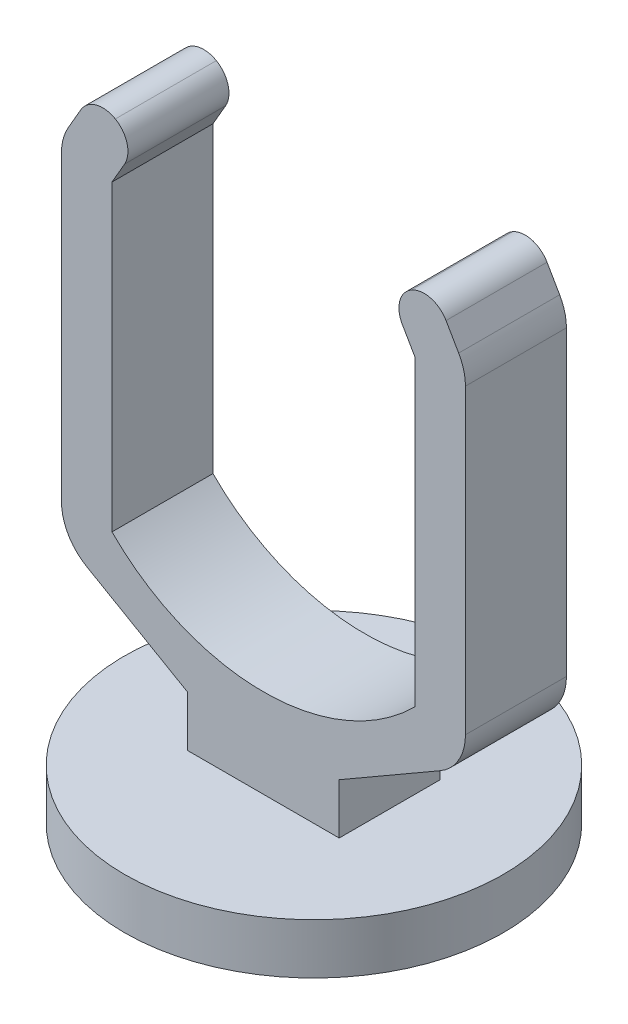
ISO-10303-21;
HEADER;
FILE_DESCRIPTION(('STEP AP214'),'2;1');
FILE_NAME('part.step','',(''),(''),'','','');
FILE_SCHEMA(('AUTOMOTIVE_DESIGN { 1 0 10303 214 1 1 1 1 }'));
ENDSEC;
DATA;
#1=APPLICATION_CONTEXT('core data for automotive mechanical design processes');
#2=APPLICATION_PROTOCOL_DEFINITION('international standard','automotive_design',2000,#1);
#3=PRODUCT_CONTEXT('',#1,'mechanical');
#4=PRODUCT('Part','Part','',(#3));
#5=PRODUCT_RELATED_PRODUCT_CATEGORY('part','',(#4));
#6=PRODUCT_DEFINITION_FORMATION('','',#4);
#7=PRODUCT_DEFINITION_CONTEXT('part definition',#1,'design');
#8=PRODUCT_DEFINITION('design','',#6,#7);
#9=PRODUCT_DEFINITION_SHAPE('','',#8);
#10=(LENGTH_UNIT() NAMED_UNIT(*) SI_UNIT(.MILLI.,.METRE.));
#11=(NAMED_UNIT(*) PLANE_ANGLE_UNIT() SI_UNIT($,.RADIAN.));
#12=(NAMED_UNIT(*) SI_UNIT($,.STERADIAN.) SOLID_ANGLE_UNIT());
#13=UNCERTAINTY_MEASURE_WITH_UNIT(LENGTH_MEASURE(1.E-05),#10,'distance_accuracy_value','');
#14=(GEOMETRIC_REPRESENTATION_CONTEXT(3) GLOBAL_UNCERTAINTY_ASSIGNED_CONTEXT((#13)) GLOBAL_UNIT_ASSIGNED_CONTEXT((#10,
#11,#12)) REPRESENTATION_CONTEXT('',''));
#15=CARTESIAN_POINT('',(0.,0.,0.));
#16=DIRECTION('',(0.,0.,1.));
#17=DIRECTION('',(1.,0.,0.));
#18=AXIS2_PLACEMENT_3D('',#15,#16,#17);
#19=CARTESIAN_POINT('',(0.,10.,0.));
#20=DIRECTION('',(0.,1.,0.));
#21=DIRECTION('',(0.,0.,1.));
#22=AXIS2_PLACEMENT_3D('',#19,#20,#21);
#23=PLANE('',#22);
#24=CARTESIAN_POINT('',(0.,10.,0.));
#25=DIRECTION('',(0.,1.,0.));
#26=DIRECTION('',(0.,0.,1.));
#27=AXIS2_PLACEMENT_3D('',#24,#25,#26);
#28=CIRCLE('',#27,37.5);
#29=CARTESIAN_POINT('',(0.,10.,37.5));
#30=VERTEX_POINT('',#29);
#31=EDGE_CURVE('E295',#30,#30,#28,.T.);
#32=ORIENTED_EDGE('',*,*,#31,.T.);
#33=EDGE_LOOP('',(#32));
#34=FACE_BOUND('',#33,.T.);
#35=DIRECTION('',(0.,0.,1.));
#36=VECTOR('',#35,1.);
#37=CARTESIAN_POINT('',(-15.,10.,0.));
#38=LINE('',#37,#36);
#39=CARTESIAN_POINT('',(-15.,10.,-10.));
#40=VERTEX_POINT('',#39);
#41=CARTESIAN_POINT('',(-15.,10.,10.));
#42=VERTEX_POINT('',#41);
#43=EDGE_CURVE('E291',#40,#42,#38,.T.);
#44=ORIENTED_EDGE('',*,*,#43,.F.);
#45=DIRECTION('',(1.,0.,0.));
#46=VECTOR('',#45,1.);
#47=CARTESIAN_POINT('',(0.,10.,-10.));
#48=LINE('',#47,#46);
#49=CARTESIAN_POINT('',(15.,10.,-10.));
#50=VERTEX_POINT('',#49);
#51=EDGE_CURVE('E287',#40,#50,#48,.T.);
#52=ORIENTED_EDGE('',*,*,#51,.T.);
#53=DIRECTION('',(0.,0.,-1.));
#54=VECTOR('',#53,1.);
#55=CARTESIAN_POINT('',(15.,10.,0.));
#56=LINE('',#55,#54);
#57=CARTESIAN_POINT('',(15.,10.,10.));
#58=VERTEX_POINT('',#57);
#59=EDGE_CURVE('E289',#58,#50,#56,.T.);
#60=ORIENTED_EDGE('',*,*,#59,.F.);
#61=DIRECTION('',(1.,0.,0.));
#62=VECTOR('',#61,1.);
#63=CARTESIAN_POINT('',(0.,10.,10.));
#64=LINE('',#63,#62);
#65=EDGE_CURVE('E195',#42,#58,#64,.T.);
#66=ORIENTED_EDGE('',*,*,#65,.F.);
#67=EDGE_LOOP('',(#44,#52,#60,#66));
#68=FACE_BOUND('',#67,.T.);
#69=ADVANCED_FACE('F36',(#34,#68),#23,.T.);
#70=CARTESIAN_POINT('',(0.,10.,0.));
#71=DIRECTION('',(0.,-1.,0.));
#72=DIRECTION('',(0.,0.,-1.));
#73=AXIS2_PLACEMENT_3D('',#70,#71,#72);
#74=CYLINDRICAL_SURFACE('',#73,37.5);
#75=ORIENTED_EDGE('',*,*,#31,.F.);
#76=EDGE_LOOP('',(#75));
#77=FACE_BOUND('',#76,.T.);
#78=CARTESIAN_POINT('',(0.,0.,0.));
#79=DIRECTION('',(0.,1.,0.));
#80=DIRECTION('',(0.,0.,1.));
#81=AXIS2_PLACEMENT_3D('',#78,#79,#80);
#82=CIRCLE('',#81,37.5);
#83=CARTESIAN_POINT('',(0.,0.,37.5));
#84=VERTEX_POINT('',#83);
#85=EDGE_CURVE('E294',#84,#84,#82,.T.);
#86=ORIENTED_EDGE('',*,*,#85,.T.);
#87=EDGE_LOOP('',(#86));
#88=FACE_BOUND('',#87,.T.);
#89=ADVANCED_FACE('F442',(#77,#88),#74,.T.);
#90=CARTESIAN_POINT('',(0.,0.,0.));
#91=DIRECTION('',(0.,1.,0.));
#92=DIRECTION('',(0.,0.,1.));
#93=AXIS2_PLACEMENT_3D('',#90,#91,#92);
#94=PLANE('',#93);
#95=ORIENTED_EDGE('',*,*,#85,.F.);
#96=EDGE_LOOP('',(#95));
#97=FACE_BOUND('',#96,.T.);
#98=ADVANCED_FACE('F448',(#97),#94,.F.);
#99=CARTESIAN_POINT('',(-15.,20.,-10.));
#100=DIRECTION('',(-1.,0.,0.));
#101=DIRECTION('',(0.,-1.,0.));
#102=AXIS2_PLACEMENT_3D('',#99,#100,#101);
#103=PLANE('',#102);
#104=DIRECTION('',(0.,-1.,0.));
#105=VECTOR('',#104,1.);
#106=CARTESIAN_POINT('',(-15.,20.,-10.));
#107=LINE('',#106,#105);
#108=CARTESIAN_POINT('',(-15.,20.,-10.));
#109=VERTEX_POINT('',#108);
#110=EDGE_CURVE('E209',#109,#40,#107,.T.);
#111=ORIENTED_EDGE('',*,*,#110,.T.);
#112=ORIENTED_EDGE('',*,*,#43,.T.);
#113=DIRECTION('',(0.,-1.,0.));
#114=VECTOR('',#113,1.);
#115=CARTESIAN_POINT('',(-15.,20.,10.));
#116=LINE('',#115,#114);
#117=CARTESIAN_POINT('',(-15.,20.,10.));
#118=VERTEX_POINT('',#117);
#119=EDGE_CURVE('E243',#118,#42,#116,.T.);
#120=ORIENTED_EDGE('',*,*,#119,.F.);
#121=DIRECTION('',(0.,0.,1.));
#122=VECTOR('',#121,1.);
#123=CARTESIAN_POINT('',(-15.,20.,-10.));
#124=LINE('',#123,#122);
#125=EDGE_CURVE('E275',#109,#118,#124,.T.);
#126=ORIENTED_EDGE('',*,*,#125,.F.);
#127=EDGE_LOOP('',(#111,#112,#120,#126));
#128=FACE_BOUND('',#127,.T.);
#129=ADVANCED_FACE('F439',(#128),#103,.T.);
#130=CARTESIAN_POINT('',(-40.,34.4337567297405,-10.));
#131=DIRECTION('',(-0.499999999999998,-0.86602540378444,0.));
#132=DIRECTION('',(0.86602540378444,-0.499999999999998,0.));
#133=AXIS2_PLACEMENT_3D('',#130,#131,#132);
#134=PLANE('',#133);
#135=DIRECTION('',(0.86602540378444,-0.499999999999998,0.));
#136=VECTOR('',#135,1.);
#137=CARTESIAN_POINT('',(-40.,34.4337567297405,10.));
#138=LINE('',#137,#136);
#139=CARTESIAN_POINT('',(-35.,31.5470053837924,10.));
#140=VERTEX_POINT('',#139);
#141=EDGE_CURVE('E241',#140,#118,#138,.T.);
#142=ORIENTED_EDGE('',*,*,#141,.F.);
#143=DIRECTION('',(0.,0.,1.));
#144=VECTOR('',#143,1.);
#145=CARTESIAN_POINT('',(-35.,31.5470053837924,-10.));
#146=LINE('',#145,#144);
#147=CARTESIAN_POINT('',(-35.,31.5470053837924,-10.));
#148=VERTEX_POINT('',#147);
#149=EDGE_CURVE('E44',#140,#148,#146,.F.);
#150=ORIENTED_EDGE('',*,*,#149,.T.);
#151=DIRECTION('',(0.86602540378444,-0.499999999999998,0.));
#152=VECTOR('',#151,1.);
#153=CARTESIAN_POINT('',(-40.,34.4337567297405,-10.));
#154=LINE('',#153,#152);
#155=EDGE_CURVE('E271',#148,#109,#154,.T.);
#156=ORIENTED_EDGE('',*,*,#155,.T.);
#157=ORIENTED_EDGE('',*,*,#125,.T.);
#158=EDGE_LOOP('',(#142,#150,#156,#157));
#159=FACE_BOUND('',#158,.T.);
#160=ADVANCED_FACE('F362',(#159),#134,.T.);
#161=CARTESIAN_POINT('',(-40.0000000000001,102.679491924311,-10.));
#162=DIRECTION('',(-1.,0.,0.));
#163=DIRECTION('',(0.,-1.,0.));
#164=AXIS2_PLACEMENT_3D('',#161,#162,#163);
#165=PLANE('',#164);
#166=DIRECTION('',(0.,-1.,0.));
#167=VECTOR('',#166,1.);
#168=CARTESIAN_POINT('',(-40.0000000000001,102.679491924311,-10.));
#169=LINE('',#168,#167);
#170=CARTESIAN_POINT('',(-40.0000000000001,100.,-10.));
#171=VERTEX_POINT('',#170);
#172=CARTESIAN_POINT('',(-40.,40.2072594216368,-10.));
#173=VERTEX_POINT('',#172);
#174=EDGE_CURVE('E269',#171,#173,#169,.T.);
#175=ORIENTED_EDGE('',*,*,#174,.T.);
#176=DIRECTION('',(0.,0.,1.));
#177=VECTOR('',#176,1.);
#178=CARTESIAN_POINT('',(-40.,40.2072594216368,-10.));
#179=LINE('',#178,#177);
#180=CARTESIAN_POINT('',(-40.,40.2072594216368,10.));
#181=VERTEX_POINT('',#180);
#182=EDGE_CURVE('E357',#173,#181,#179,.T.);
#183=ORIENTED_EDGE('',*,*,#182,.T.);
#184=DIRECTION('',(0.,-1.,0.));
#185=VECTOR('',#184,1.);
#186=CARTESIAN_POINT('',(-40.0000000000001,102.679491924311,10.));
#187=LINE('',#186,#185);
#188=CARTESIAN_POINT('',(-40.0000000000001,100.,10.));
#189=VERTEX_POINT('',#188);
#190=EDGE_CURVE('E238',#189,#181,#187,.T.);
#191=ORIENTED_EDGE('',*,*,#190,.F.);
#192=DIRECTION('',(0.,0.,1.));
#193=VECTOR('',#192,1.);
#194=CARTESIAN_POINT('',(-40.0000000000001,100.,-10.));
#195=LINE('',#194,#193);
#196=EDGE_CURVE('E355',#189,#171,#195,.F.);
#197=ORIENTED_EDGE('',*,*,#196,.T.);
#198=EDGE_LOOP('',(#175,#183,#191,#197));
#199=FACE_BOUND('',#198,.T.);
#200=ADVANCED_FACE('F373',(#199),#165,.T.);
#201=CARTESIAN_POINT('',(-33.6602540378445,113.660254037844,-10.));
#202=DIRECTION('',(-0.866025403784439,0.499999999999999,0.));
#203=DIRECTION('',(-0.499999999999999,-0.866025403784439,0.));
#204=AXIS2_PLACEMENT_3D('',#201,#202,#203);
#205=PLANE('',#204);
#206=DIRECTION('',(-0.499999999999999,-0.866025403784439,0.));
#207=VECTOR('',#206,1.);
#208=CARTESIAN_POINT('',(-33.6602540378445,113.660254037844,-10.));
#209=LINE('',#208,#207);
#210=CARTESIAN_POINT('',(-36.1602540378445,109.330127018922,-10.));
#211=VERTEX_POINT('',#210);
#212=CARTESIAN_POINT('',(-38.6602540378445,105.,-10.));
#213=VERTEX_POINT('',#212);
#214=EDGE_CURVE('E267',#211,#213,#209,.T.);
#215=ORIENTED_EDGE('',*,*,#214,.T.);
#216=DIRECTION('',(0.,0.,1.));
#217=VECTOR('',#216,1.);
#218=CARTESIAN_POINT('',(-38.6602540378445,105.,-10.));
#219=LINE('',#218,#217);
#220=CARTESIAN_POINT('',(-38.6602540378445,105.,10.));
#221=VERTEX_POINT('',#220);
#222=EDGE_CURVE('E11',#213,#221,#219,.T.);
#223=ORIENTED_EDGE('',*,*,#222,.T.);
#224=DIRECTION('',(-0.499999999999999,-0.866025403784439,0.));
#225=VECTOR('',#224,1.);
#226=CARTESIAN_POINT('',(-33.6602540378445,113.660254037844,10.));
#227=LINE('',#226,#225);
#228=CARTESIAN_POINT('',(-36.1602540378445,109.330127018922,10.));
#229=VERTEX_POINT('',#228);
#230=EDGE_CURVE('E235',#229,#221,#227,.T.);
#231=ORIENTED_EDGE('',*,*,#230,.F.);
#232=DIRECTION('',(0.,0.,1.));
#233=VECTOR('',#232,1.);
#234=CARTESIAN_POINT('',(-36.1602540378445,109.330127018922,-10.));
#235=LINE('',#234,#233);
#236=EDGE_CURVE('E326',#229,#211,#235,.F.);
#237=ORIENTED_EDGE('',*,*,#236,.T.);
#238=EDGE_LOOP('',(#215,#223,#231,#237));
#239=FACE_BOUND('',#238,.T.);
#240=ADVANCED_FACE('F379',(#239),#205,.T.);
#241=CARTESIAN_POINT('',(-30.0000000000001,100.,-10.));
#242=DIRECTION('',(0.866025403784438,-0.5,0.));
#243=DIRECTION('',(0.5,0.866025403784439,0.));
#244=AXIS2_PLACEMENT_3D('',#241,#242,#243);
#245=PLANE('',#244);
#246=DIRECTION('',(0.5,0.866025403784439,0.));
#247=VECTOR('',#246,1.);
#248=CARTESIAN_POINT('',(-30.0000000000001,100.,-10.));
#249=LINE('',#248,#247);
#250=CARTESIAN_POINT('',(-30.0000000000001,100.,-10.));
#251=VERTEX_POINT('',#250);
#252=CARTESIAN_POINT('',(-27.5000000000001,104.330127018922,-10.));
#253=VERTEX_POINT('',#252);
#254=EDGE_CURVE('E264',#251,#253,#249,.T.);
#255=ORIENTED_EDGE('',*,*,#254,.T.);
#256=DIRECTION('',(0.,0.,1.));
#257=VECTOR('',#256,1.);
#258=CARTESIAN_POINT('',(-27.5000000000001,104.330127018922,-10.));
#259=LINE('',#258,#257);
#260=CARTESIAN_POINT('',(-27.5000000000001,104.330127018922,10.));
#261=VERTEX_POINT('',#260);
#262=EDGE_CURVE('E323',#253,#261,#259,.T.);
#263=ORIENTED_EDGE('',*,*,#262,.T.);
#264=DIRECTION('',(0.5,0.866025403784439,0.));
#265=VECTOR('',#264,1.);
#266=CARTESIAN_POINT('',(-30.0000000000001,100.,10.));
#267=LINE('',#266,#265);
#268=CARTESIAN_POINT('',(-30.0000000000001,100.,10.));
#269=VERTEX_POINT('',#268);
#270=EDGE_CURVE('E232',#269,#261,#267,.T.);
#271=ORIENTED_EDGE('',*,*,#270,.F.);
#272=DIRECTION('',(0.,0.,1.));
#273=VECTOR('',#272,1.);
#274=CARTESIAN_POINT('',(-30.0000000000001,100.,-10.));
#275=LINE('',#274,#273);
#276=EDGE_CURVE('E278',#251,#269,#275,.T.);
#277=ORIENTED_EDGE('',*,*,#276,.F.);
#278=EDGE_LOOP('',(#255,#263,#271,#277));
#279=FACE_BOUND('',#278,.T.);
#280=ADVANCED_FACE('F393',(#279),#245,.T.);
#281=CARTESIAN_POINT('',(-30.0000000000001,40.,-10.));
#282=DIRECTION('',(1.,0.,0.));
#283=DIRECTION('',(0.,0.,-1.));
#284=AXIS2_PLACEMENT_3D('',#281,#282,#283);
#285=PLANE('',#284);
#286=ORIENTED_EDGE('',*,*,#276,.T.);
#287=DIRECTION('',(0.,1.,0.));
#288=VECTOR('',#287,1.);
#289=CARTESIAN_POINT('',(-30.0000000000001,40.,10.));
#290=LINE('',#289,#288);
#291=CARTESIAN_POINT('',(-30.0000000000001,40.,10.));
#292=VERTEX_POINT('',#291);
#293=EDGE_CURVE('E229',#292,#269,#290,.T.);
#294=ORIENTED_EDGE('',*,*,#293,.F.);
#295=DIRECTION('',(0.,0.,1.));
#296=VECTOR('',#295,1.);
#297=CARTESIAN_POINT('',(-30.0000000000001,40.,-10.));
#298=LINE('',#297,#296);
#299=CARTESIAN_POINT('',(-30.0000000000001,40.,-10.));
#300=VERTEX_POINT('',#299);
#301=EDGE_CURVE('E280',#300,#292,#298,.T.);
#302=ORIENTED_EDGE('',*,*,#301,.F.);
#303=DIRECTION('',(0.,1.,0.));
#304=VECTOR('',#303,1.);
#305=CARTESIAN_POINT('',(-30.0000000000001,40.,-10.));
#306=LINE('',#305,#304);
#307=EDGE_CURVE('E261',#300,#251,#306,.T.);
#308=ORIENTED_EDGE('',*,*,#307,.T.);
#309=EDGE_LOOP('',(#286,#294,#302,#308));
#310=FACE_BOUND('',#309,.T.);
#311=ADVANCED_FACE('F397',(#310),#285,.T.);
#312=CARTESIAN_POINT('',(0.,70.,-10.));
#313=DIRECTION('',(0.,0.,1.));
#314=DIRECTION('',(1.,0.,0.));
#315=AXIS2_PLACEMENT_3D('',#312,#313,#314);
#316=CYLINDRICAL_SURFACE('',#315,42.4264068711928);
#317=ORIENTED_EDGE('',*,*,#301,.T.);
#318=CARTESIAN_POINT('',(0.,70.,10.));
#319=DIRECTION('',(0.,0.,-1.));
#320=DIRECTION('',(1.,0.,0.));
#321=AXIS2_PLACEMENT_3D('',#318,#319,#320);
#322=CIRCLE('',#321,42.4264068711928);
#323=CARTESIAN_POINT('',(29.9999999999999,40.,10.));
#324=VERTEX_POINT('',#323);
#325=EDGE_CURVE('E226',#324,#292,#322,.T.);
#326=ORIENTED_EDGE('',*,*,#325,.F.);
#327=DIRECTION('',(0.,0.,1.));
#328=VECTOR('',#327,1.);
#329=CARTESIAN_POINT('',(29.9999999999999,40.,-10.));
#330=LINE('',#329,#328);
#331=CARTESIAN_POINT('',(29.9999999999999,40.,-10.));
#332=VERTEX_POINT('',#331);
#333=EDGE_CURVE('E282',#332,#324,#330,.T.);
#334=ORIENTED_EDGE('',*,*,#333,.F.);
#335=CARTESIAN_POINT('',(0.,70.,-10.));
#336=DIRECTION('',(0.,0.,-1.));
#337=DIRECTION('',(1.,0.,0.));
#338=AXIS2_PLACEMENT_3D('',#335,#336,#337);
#339=CIRCLE('',#338,42.4264068711928);
#340=EDGE_CURVE('E258',#332,#300,#339,.T.);
#341=ORIENTED_EDGE('',*,*,#340,.T.);
#342=EDGE_LOOP('',(#317,#326,#334,#341));
#343=FACE_BOUND('',#342,.T.);
#344=ADVANCED_FACE('F401',(#343),#316,.F.);
#345=CARTESIAN_POINT('',(29.9999999999999,100.,-10.));
#346=DIRECTION('',(-1.,0.,0.));
#347=DIRECTION('',(0.,-1.,0.));
#348=AXIS2_PLACEMENT_3D('',#345,#346,#347);
#349=PLANE('',#348);
#350=ORIENTED_EDGE('',*,*,#333,.T.);
#351=DIRECTION('',(0.,-1.,0.));
#352=VECTOR('',#351,1.);
#353=CARTESIAN_POINT('',(29.9999999999999,100.,10.));
#354=LINE('',#353,#352);
#355=CARTESIAN_POINT('',(29.9999999999999,100.,10.));
#356=VERTEX_POINT('',#355);
#357=EDGE_CURVE('E223',#356,#324,#354,.T.);
#358=ORIENTED_EDGE('',*,*,#357,.F.);
#359=DIRECTION('',(0.,0.,1.));
#360=VECTOR('',#359,1.);
#361=CARTESIAN_POINT('',(29.9999999999999,100.,-10.));
#362=LINE('',#361,#360);
#363=CARTESIAN_POINT('',(29.9999999999999,100.,-10.));
#364=VERTEX_POINT('',#363);
#365=EDGE_CURVE('E208',#364,#356,#362,.T.);
#366=ORIENTED_EDGE('',*,*,#365,.F.);
#367=DIRECTION('',(0.,-1.,0.));
#368=VECTOR('',#367,1.);
#369=CARTESIAN_POINT('',(29.9999999999999,100.,-10.));
#370=LINE('',#369,#368);
#371=EDGE_CURVE('E255',#364,#332,#370,.T.);
#372=ORIENTED_EDGE('',*,*,#371,.T.);
#373=EDGE_LOOP('',(#350,#358,#366,#372));
#374=FACE_BOUND('',#373,.T.);
#375=ADVANCED_FACE('F407',(#374),#349,.T.);
#376=CARTESIAN_POINT('',(24.9999999999999,108.660254037844,-10.));
#377=DIRECTION('',(-0.866025403784437,-0.500000000000002,0.));
#378=DIRECTION('',(0.500000000000002,-0.866025403784437,0.));
#379=AXIS2_PLACEMENT_3D('',#376,#377,#378);
#380=PLANE('',#379);
#381=DIRECTION('',(0.500000000000002,-0.866025403784437,0.));
#382=VECTOR('',#381,1.);
#383=CARTESIAN_POINT('',(24.9999999999999,108.660254037844,10.));
#384=LINE('',#383,#382);
#385=CARTESIAN_POINT('',(27.4999999999999,104.330127018922,10.));
#386=VERTEX_POINT('',#385);
#387=EDGE_CURVE('E221',#386,#356,#384,.T.);
#388=ORIENTED_EDGE('',*,*,#387,.F.);
#389=DIRECTION('',(0.,0.,1.));
#390=VECTOR('',#389,1.);
#391=CARTESIAN_POINT('',(27.4999999999999,104.330127018922,-10.));
#392=LINE('',#391,#390);
#393=CARTESIAN_POINT('',(27.4999999999999,104.330127018922,-10.));
#394=VERTEX_POINT('',#393);
#395=EDGE_CURVE('E308',#386,#394,#392,.F.);
#396=ORIENTED_EDGE('',*,*,#395,.T.);
#397=DIRECTION('',(0.500000000000002,-0.866025403784437,0.));
#398=VECTOR('',#397,1.);
#399=CARTESIAN_POINT('',(24.9999999999999,108.660254037844,-10.));
#400=LINE('',#399,#398);
#401=EDGE_CURVE('E253',#394,#364,#400,.T.);
#402=ORIENTED_EDGE('',*,*,#401,.T.);
#403=ORIENTED_EDGE('',*,*,#365,.T.);
#404=EDGE_LOOP('',(#388,#396,#402,#403));
#405=FACE_BOUND('',#404,.T.);
#406=ADVANCED_FACE('F410',(#405),#380,.T.);
#407=CARTESIAN_POINT('',(39.9999999999999,102.679491924311,-10.));
#408=DIRECTION('',(0.866025403784438,0.500000000000002,0.));
#409=DIRECTION('',(-0.500000000000002,0.866025403784438,0.));
#410=AXIS2_PLACEMENT_3D('',#407,#408,#409);
#411=PLANE('',#410);
#412=DIRECTION('',(-0.500000000000002,0.866025403784438,0.));
#413=VECTOR('',#412,1.);
#414=CARTESIAN_POINT('',(39.9999999999999,102.679491924311,10.));
#415=LINE('',#414,#413);
#416=CARTESIAN_POINT('',(38.6602540378443,105.,10.));
#417=VERTEX_POINT('',#416);
#418=CARTESIAN_POINT('',(36.1602540378443,109.330127018922,10.));
#419=VERTEX_POINT('',#418);
#420=EDGE_CURVE('E217',#417,#419,#415,.T.);
#421=ORIENTED_EDGE('',*,*,#420,.F.);
#422=DIRECTION('',(0.,0.,1.));
#423=VECTOR('',#422,1.);
#424=CARTESIAN_POINT('',(38.6602540378443,105.,-10.));
#425=LINE('',#424,#423);
#426=CARTESIAN_POINT('',(38.6602540378443,105.,-10.));
#427=VERTEX_POINT('',#426);
#428=EDGE_CURVE('E346',#417,#427,#425,.F.);
#429=ORIENTED_EDGE('',*,*,#428,.T.);
#430=DIRECTION('',(-0.500000000000002,0.866025403784438,0.));
#431=VECTOR('',#430,1.);
#432=CARTESIAN_POINT('',(39.9999999999999,102.679491924311,-10.));
#433=LINE('',#432,#431);
#434=CARTESIAN_POINT('',(36.1602540378443,109.330127018922,-10.));
#435=VERTEX_POINT('',#434);
#436=EDGE_CURVE('E251',#427,#435,#433,.T.);
#437=ORIENTED_EDGE('',*,*,#436,.T.);
#438=DIRECTION('',(0.,0.,1.));
#439=VECTOR('',#438,1.);
#440=CARTESIAN_POINT('',(36.1602540378443,109.330127018922,-10.));
#441=LINE('',#440,#439);
#442=EDGE_CURVE('E320',#435,#419,#441,.T.);
#443=ORIENTED_EDGE('',*,*,#442,.T.);
#444=EDGE_LOOP('',(#421,#429,#437,#443));
#445=FACE_BOUND('',#444,.T.);
#446=ADVANCED_FACE('F424',(#445),#411,.T.);
#447=CARTESIAN_POINT('',(40.,34.4337567297406,-10.));
#448=DIRECTION('',(1.,0.,0.));
#449=DIRECTION('',(0.,1.,0.));
#450=AXIS2_PLACEMENT_3D('',#447,#448,#449);
#451=PLANE('',#450);
#452=DIRECTION('',(0.,1.,0.));
#453=VECTOR('',#452,1.);
#454=CARTESIAN_POINT('',(40.,34.4337567297406,-10.));
#455=LINE('',#454,#453);
#456=CARTESIAN_POINT('',(40.,40.2072594216368,-10.));
#457=VERTEX_POINT('',#456);
#458=CARTESIAN_POINT('',(39.9999999999999,100.,-10.));
#459=VERTEX_POINT('',#458);
#460=EDGE_CURVE('E248',#457,#459,#455,.T.);
#461=ORIENTED_EDGE('',*,*,#460,.T.);
#462=DIRECTION('',(0.,0.,1.));
#463=VECTOR('',#462,1.);
#464=CARTESIAN_POINT('',(39.9999999999999,100.,-10.));
#465=LINE('',#464,#463);
#466=CARTESIAN_POINT('',(39.9999999999999,100.,10.));
#467=VERTEX_POINT('',#466);
#468=EDGE_CURVE('E335',#459,#467,#465,.T.);
#469=ORIENTED_EDGE('',*,*,#468,.T.);
#470=DIRECTION('',(0.,1.,0.));
#471=VECTOR('',#470,1.);
#472=CARTESIAN_POINT('',(40.,34.4337567297406,10.));
#473=LINE('',#472,#471);
#474=CARTESIAN_POINT('',(40.,40.2072594216368,10.));
#475=VERTEX_POINT('',#474);
#476=EDGE_CURVE('E215',#475,#467,#473,.T.);
#477=ORIENTED_EDGE('',*,*,#476,.F.);
#478=DIRECTION('',(0.,0.,1.));
#479=VECTOR('',#478,1.);
#480=CARTESIAN_POINT('',(40.,40.2072594216368,-10.));
#481=LINE('',#480,#479);
#482=EDGE_CURVE('E328',#475,#457,#481,.F.);
#483=ORIENTED_EDGE('',*,*,#482,.T.);
#484=EDGE_LOOP('',(#461,#469,#477,#483));
#485=FACE_BOUND('',#484,.T.);
#486=ADVANCED_FACE('F432',(#485),#451,.T.);
#487=CARTESIAN_POINT('',(15.,20.,-10.));
#488=DIRECTION('',(0.499999999999998,-0.86602540378444,0.));
#489=DIRECTION('',(0.86602540378444,0.499999999999998,0.));
#490=AXIS2_PLACEMENT_3D('',#487,#488,#489);
#491=PLANE('',#490);
#492=DIRECTION('',(0.86602540378444,0.499999999999998,0.));
#493=VECTOR('',#492,1.);
#494=CARTESIAN_POINT('',(15.,20.,-10.));
#495=LINE('',#494,#493);
#496=CARTESIAN_POINT('',(15.,20.,-10.));
#497=VERTEX_POINT('',#496);
#498=CARTESIAN_POINT('',(35.,31.5470053837924,-10.));
#499=VERTEX_POINT('',#498);
#500=EDGE_CURVE('E246',#497,#499,#495,.T.);
#501=ORIENTED_EDGE('',*,*,#500,.T.);
#502=DIRECTION('',(0.,0.,1.));
#503=VECTOR('',#502,1.);
#504=CARTESIAN_POINT('',(35.,31.5470053837924,-10.));
#505=LINE('',#504,#503);
#506=CARTESIAN_POINT('',(35.,31.5470053837924,10.));
#507=VERTEX_POINT('',#506);
#508=EDGE_CURVE('E214',#499,#507,#505,.T.);
#509=ORIENTED_EDGE('',*,*,#508,.T.);
#510=DIRECTION('',(0.86602540378444,0.499999999999998,0.));
#511=VECTOR('',#510,1.);
#512=CARTESIAN_POINT('',(15.,20.,10.));
#513=LINE('',#512,#511);
#514=CARTESIAN_POINT('',(15.,20.,10.));
#515=VERTEX_POINT('',#514);
#516=EDGE_CURVE('E193',#515,#507,#513,.T.);
#517=ORIENTED_EDGE('',*,*,#516,.F.);
#518=DIRECTION('',(0.,0.,1.));
#519=VECTOR('',#518,1.);
#520=CARTESIAN_POINT('',(15.,20.,-10.));
#521=LINE('',#520,#519);
#522=EDGE_CURVE('E201',#497,#515,#521,.T.);
#523=ORIENTED_EDGE('',*,*,#522,.F.);
#524=EDGE_LOOP('',(#501,#509,#517,#523));
#525=FACE_BOUND('',#524,.T.);
#526=ADVANCED_FACE('F212',(#525),#491,.T.);
#527=CARTESIAN_POINT('',(15.,0.,-10.));
#528=DIRECTION('',(1.,0.,0.));
#529=DIRECTION('',(0.,0.,-1.));
#530=AXIS2_PLACEMENT_3D('',#527,#528,#529);
#531=PLANE('',#530);
#532=DIRECTION('',(0.,1.,0.));
#533=VECTOR('',#532,1.);
#534=CARTESIAN_POINT('',(15.,0.,10.));
#535=LINE('',#534,#533);
#536=EDGE_CURVE('E188',#58,#515,#535,.T.);
#537=ORIENTED_EDGE('',*,*,#536,.F.);
#538=ORIENTED_EDGE('',*,*,#59,.T.);
#539=DIRECTION('',(0.,1.,0.));
#540=VECTOR('',#539,1.);
#541=CARTESIAN_POINT('',(15.,0.,-10.));
#542=LINE('',#541,#540);
#543=EDGE_CURVE('E204',#50,#497,#542,.T.);
#544=ORIENTED_EDGE('',*,*,#543,.T.);
#545=ORIENTED_EDGE('',*,*,#522,.T.);
#546=EDGE_LOOP('',(#537,#538,#544,#545));
#547=FACE_BOUND('',#546,.T.);
#548=ADVANCED_FACE('F202',(#547),#531,.T.);
#549=CARTESIAN_POINT('',(0.,70.,-10.));
#550=DIRECTION('',(0.,0.,1.));
#551=DIRECTION('',(1.,0.,0.));
#552=AXIS2_PLACEMENT_3D('',#549,#550,#551);
#553=PLANE('',#552);
#554=ORIENTED_EDGE('',*,*,#436,.F.);
#555=CARTESIAN_POINT('',(29.9999999999999,100.,-10.));
#556=DIRECTION('',(0.,0.,1.));
#557=DIRECTION('',(1.,0.,0.));
#558=AXIS2_PLACEMENT_3D('',#555,#556,#557);
#559=CIRCLE('',#558,10.);
#560=EDGE_CURVE('E352',#427,#459,#559,.F.);
#561=ORIENTED_EDGE('',*,*,#560,.T.);
#562=ORIENTED_EDGE('',*,*,#460,.F.);
#563=CARTESIAN_POINT('',(30.,40.2072594216368,-10.));
#564=DIRECTION('',(0.,0.,1.));
#565=DIRECTION('',(1.,0.,0.));
#566=AXIS2_PLACEMENT_3D('',#563,#564,#565);
#567=CIRCLE('',#566,10.);
#568=EDGE_CURVE('E350',#457,#499,#567,.F.);
#569=ORIENTED_EDGE('',*,*,#568,.T.);
#570=ORIENTED_EDGE('',*,*,#500,.F.);
#571=ORIENTED_EDGE('',*,*,#543,.F.);
#572=ORIENTED_EDGE('',*,*,#51,.F.);
#573=ORIENTED_EDGE('',*,*,#110,.F.);
#574=ORIENTED_EDGE('',*,*,#155,.F.);
#575=CARTESIAN_POINT('',(-30.,40.2072594216368,-10.));
#576=DIRECTION('',(0.,0.,1.));
#577=DIRECTION('',(1.,0.,0.));
#578=AXIS2_PLACEMENT_3D('',#575,#576,#577);
#579=CIRCLE('',#578,10.);
#580=EDGE_CURVE('E57',#148,#173,#579,.F.);
#581=ORIENTED_EDGE('',*,*,#580,.T.);
#582=ORIENTED_EDGE('',*,*,#174,.F.);
#583=CARTESIAN_POINT('',(-30.0000000000001,100.,-10.));
#584=DIRECTION('',(0.,0.,1.));
#585=DIRECTION('',(1.,0.,0.));
#586=AXIS2_PLACEMENT_3D('',#583,#584,#585);
#587=CIRCLE('',#586,10.);
#588=EDGE_CURVE('E51',#171,#213,#587,.F.);
#589=ORIENTED_EDGE('',*,*,#588,.T.);
#590=ORIENTED_EDGE('',*,*,#214,.F.);
#591=CARTESIAN_POINT('',(-31.8301270189223,106.830127018922,-10.));
#592=DIRECTION('',(0.,0.,1.));
#593=DIRECTION('',(1.,0.,0.));
#594=AXIS2_PLACEMENT_3D('',#591,#592,#593);
#595=CIRCLE('',#594,5.);
#596=CARTESIAN_POINT('',(-29.3301270189223,111.160254037844,-10.));
#597=VERTEX_POINT('',#596);
#598=EDGE_CURVE('E311',#211,#597,#595,.F.);
#599=ORIENTED_EDGE('',*,*,#598,.T.);
#600=CARTESIAN_POINT('',(-31.8301270189223,106.830127018922,-10.));
#601=DIRECTION('',(0.,0.,1.));
#602=DIRECTION('',(1.,0.,0.));
#603=AXIS2_PLACEMENT_3D('',#600,#601,#602);
#604=CIRCLE('',#603,5.);
#605=EDGE_CURVE('E313',#597,#253,#604,.F.);
#606=ORIENTED_EDGE('',*,*,#605,.T.);
#607=ORIENTED_EDGE('',*,*,#254,.F.);
#608=ORIENTED_EDGE('',*,*,#307,.F.);
#609=ORIENTED_EDGE('',*,*,#340,.F.);
#610=ORIENTED_EDGE('',*,*,#371,.F.);
#611=ORIENTED_EDGE('',*,*,#401,.F.);
#612=CARTESIAN_POINT('',(31.8301270189221,106.830127018922,-10.));
#613=DIRECTION('',(0.,0.,1.));
#614=DIRECTION('',(1.,0.,0.));
#615=AXIS2_PLACEMENT_3D('',#612,#613,#614);
#616=CIRCLE('',#615,5.);
#617=CARTESIAN_POINT('',(29.3301270189221,111.160254037844,-10.));
#618=VERTEX_POINT('',#617);
#619=EDGE_CURVE('E318',#394,#618,#616,.F.);
#620=ORIENTED_EDGE('',*,*,#619,.T.);
#621=CARTESIAN_POINT('',(31.8301270189221,106.830127018922,-10.));
#622=DIRECTION('',(0.,0.,1.));
#623=DIRECTION('',(1.,0.,0.));
#624=AXIS2_PLACEMENT_3D('',#621,#622,#623);
#625=CIRCLE('',#624,5.);
#626=EDGE_CURVE('E315',#618,#435,#625,.F.);
#627=ORIENTED_EDGE('',*,*,#626,.T.);
#628=EDGE_LOOP('',(#554,#561,#562,#569,#570,#571,#572,#573,#574,#581,#582,#589,#590,#599,#606,
#607,#608,#609,#610,#611,#620,#627));
#629=FACE_BOUND('',#628,.T.);
#630=ADVANCED_FACE('F367',(#629),#553,.F.);
#631=CARTESIAN_POINT('',(0.,70.,10.));
#632=DIRECTION('',(0.,0.,1.));
#633=DIRECTION('',(1.,0.,0.));
#634=AXIS2_PLACEMENT_3D('',#631,#632,#633);
#635=PLANE('',#634);
#636=ORIENTED_EDGE('',*,*,#476,.T.);
#637=CARTESIAN_POINT('',(29.9999999999999,100.,10.));
#638=DIRECTION('',(0.,0.,1.));
#639=DIRECTION('',(1.,0.,0.));
#640=AXIS2_PLACEMENT_3D('',#637,#638,#639);
#641=CIRCLE('',#640,10.);
#642=EDGE_CURVE('E344',#467,#417,#641,.T.);
#643=ORIENTED_EDGE('',*,*,#642,.T.);
#644=ORIENTED_EDGE('',*,*,#420,.T.);
#645=CARTESIAN_POINT('',(31.8301270189221,106.830127018922,10.));
#646=DIRECTION('',(0.,0.,1.));
#647=DIRECTION('',(1.,0.,0.));
#648=AXIS2_PLACEMENT_3D('',#645,#646,#647);
#649=CIRCLE('',#648,5.);
#650=CARTESIAN_POINT('',(29.3301270189221,111.160254037844,10.));
#651=VERTEX_POINT('',#650);
#652=EDGE_CURVE('E304',#419,#651,#649,.T.);
#653=ORIENTED_EDGE('',*,*,#652,.T.);
#654=CARTESIAN_POINT('',(31.8301270189221,106.830127018922,10.));
#655=DIRECTION('',(0.,0.,1.));
#656=DIRECTION('',(1.,0.,0.));
#657=AXIS2_PLACEMENT_3D('',#654,#655,#656);
#658=CIRCLE('',#657,5.);
#659=EDGE_CURVE('E306',#651,#386,#658,.T.);
#660=ORIENTED_EDGE('',*,*,#659,.T.);
#661=ORIENTED_EDGE('',*,*,#387,.T.);
#662=ORIENTED_EDGE('',*,*,#357,.T.);
#663=ORIENTED_EDGE('',*,*,#325,.T.);
#664=ORIENTED_EDGE('',*,*,#293,.T.);
#665=ORIENTED_EDGE('',*,*,#270,.T.);
#666=CARTESIAN_POINT('',(-31.8301270189223,106.830127018922,10.));
#667=DIRECTION('',(0.,0.,1.));
#668=DIRECTION('',(1.,0.,0.));
#669=AXIS2_PLACEMENT_3D('',#666,#667,#668);
#670=CIRCLE('',#669,5.);
#671=CARTESIAN_POINT('',(-29.3301270189223,111.160254037844,10.));
#672=VERTEX_POINT('',#671);
#673=EDGE_CURVE('E302',#261,#672,#670,.T.);
#674=ORIENTED_EDGE('',*,*,#673,.T.);
#675=CARTESIAN_POINT('',(-31.8301270189223,106.830127018922,10.));
#676=DIRECTION('',(0.,0.,1.));
#677=DIRECTION('',(1.,0.,0.));
#678=AXIS2_PLACEMENT_3D('',#675,#676,#677);
#679=CIRCLE('',#678,5.);
#680=EDGE_CURVE('E298',#672,#229,#679,.T.);
#681=ORIENTED_EDGE('',*,*,#680,.T.);
#682=ORIENTED_EDGE('',*,*,#230,.T.);
#683=CARTESIAN_POINT('',(-30.0000000000001,100.,10.));
#684=DIRECTION('',(0.,0.,1.));
#685=DIRECTION('',(1.,0.,0.));
#686=AXIS2_PLACEMENT_3D('',#683,#684,#685);
#687=CIRCLE('',#686,10.);
#688=EDGE_CURVE('E338',#221,#189,#687,.T.);
#689=ORIENTED_EDGE('',*,*,#688,.T.);
#690=ORIENTED_EDGE('',*,*,#190,.T.);
#691=CARTESIAN_POINT('',(-30.,40.2072594216368,10.));
#692=DIRECTION('',(0.,0.,1.));
#693=DIRECTION('',(1.,0.,0.));
#694=AXIS2_PLACEMENT_3D('',#691,#692,#693);
#695=CIRCLE('',#694,10.);
#696=EDGE_CURVE('E340',#181,#140,#695,.T.);
#697=ORIENTED_EDGE('',*,*,#696,.T.);
#698=ORIENTED_EDGE('',*,*,#141,.T.);
#699=ORIENTED_EDGE('',*,*,#119,.T.);
#700=ORIENTED_EDGE('',*,*,#65,.T.);
#701=ORIENTED_EDGE('',*,*,#536,.T.);
#702=ORIENTED_EDGE('',*,*,#516,.T.);
#703=CARTESIAN_POINT('',(30.,40.2072594216368,10.));
#704=DIRECTION('',(0.,0.,1.));
#705=DIRECTION('',(1.,0.,0.));
#706=AXIS2_PLACEMENT_3D('',#703,#704,#705);
#707=CIRCLE('',#706,10.);
#708=EDGE_CURVE('E342',#507,#475,#707,.T.);
#709=ORIENTED_EDGE('',*,*,#708,.T.);
#710=EDGE_LOOP('',(#636,#643,#644,#653,#660,#661,#662,#663,#664,#665,#674,#681,#682,#689,#690,
#697,#698,#699,#700,#701,#702,#709));
#711=FACE_BOUND('',#710,.T.);
#712=ADVANCED_FACE('F191',(#711),#635,.T.);
#713=CARTESIAN_POINT('',(31.8301270189221,106.830127018922,-10.));
#714=DIRECTION('',(0.,0.,1.));
#715=DIRECTION('',(1.,0.,0.));
#716=AXIS2_PLACEMENT_3D('',#713,#714,#715);
#717=CYLINDRICAL_SURFACE('',#716,5.);
#718=ORIENTED_EDGE('',*,*,#442,.F.);
#719=ORIENTED_EDGE('',*,*,#626,.F.);
#720=DIRECTION('',(0.,0.,1.));
#721=VECTOR('',#720,1.);
#722=CARTESIAN_POINT('',(29.3301270189221,111.160254037844,-10.));
#723=LINE('',#722,#721);
#724=EDGE_CURVE('E198',#651,#618,#723,.F.);
#725=ORIENTED_EDGE('',*,*,#724,.F.);
#726=ORIENTED_EDGE('',*,*,#652,.F.);
#727=EDGE_LOOP('',(#718,#719,#725,#726));
#728=FACE_BOUND('',#727,.T.);
#729=ADVANCED_FACE('F417',(#728),#717,.T.);
#730=CARTESIAN_POINT('',(31.8301270189221,106.830127018922,-10.));
#731=DIRECTION('',(0.,0.,1.));
#732=DIRECTION('',(1.,0.,0.));
#733=AXIS2_PLACEMENT_3D('',#730,#731,#732);
#734=CYLINDRICAL_SURFACE('',#733,5.);
#735=ORIENTED_EDGE('',*,*,#619,.F.);
#736=ORIENTED_EDGE('',*,*,#395,.F.);
#737=ORIENTED_EDGE('',*,*,#659,.F.);
#738=ORIENTED_EDGE('',*,*,#724,.T.);
#739=EDGE_LOOP('',(#735,#736,#737,#738));
#740=FACE_BOUND('',#739,.T.);
#741=ADVANCED_FACE('F420',(#740),#734,.T.);
#742=CARTESIAN_POINT('',(-31.8301270189223,106.830127018922,-10.));
#743=DIRECTION('',(0.,0.,1.));
#744=DIRECTION('',(1.,0.,0.));
#745=AXIS2_PLACEMENT_3D('',#742,#743,#744);
#746=CYLINDRICAL_SURFACE('',#745,5.);
#747=DIRECTION('',(0.,0.,1.));
#748=VECTOR('',#747,1.);
#749=CARTESIAN_POINT('',(-29.3301270189223,111.160254037844,-10.));
#750=LINE('',#749,#748);
#751=EDGE_CURVE('E331',#597,#672,#750,.T.);
#752=ORIENTED_EDGE('',*,*,#751,.F.);
#753=ORIENTED_EDGE('',*,*,#598,.F.);
#754=ORIENTED_EDGE('',*,*,#236,.F.);
#755=ORIENTED_EDGE('',*,*,#680,.F.);
#756=EDGE_LOOP('',(#752,#753,#754,#755));
#757=FACE_BOUND('',#756,.T.);
#758=ADVANCED_FACE('F384',(#757),#746,.T.);
#759=CARTESIAN_POINT('',(-31.8301270189223,106.830127018922,-10.));
#760=DIRECTION('',(0.,0.,1.));
#761=DIRECTION('',(1.,0.,0.));
#762=AXIS2_PLACEMENT_3D('',#759,#760,#761);
#763=CYLINDRICAL_SURFACE('',#762,5.);
#764=ORIENTED_EDGE('',*,*,#605,.F.);
#765=ORIENTED_EDGE('',*,*,#751,.T.);
#766=ORIENTED_EDGE('',*,*,#673,.F.);
#767=ORIENTED_EDGE('',*,*,#262,.F.);
#768=EDGE_LOOP('',(#764,#765,#766,#767));
#769=FACE_BOUND('',#768,.T.);
#770=ADVANCED_FACE('F389',(#769),#763,.T.);
#771=CARTESIAN_POINT('',(29.9999999999999,100.,-10.));
#772=DIRECTION('',(0.,0.,1.));
#773=DIRECTION('',(1.,0.,0.));
#774=AXIS2_PLACEMENT_3D('',#771,#772,#773);
#775=CYLINDRICAL_SURFACE('',#774,10.);
#776=ORIENTED_EDGE('',*,*,#560,.F.);
#777=ORIENTED_EDGE('',*,*,#428,.F.);
#778=ORIENTED_EDGE('',*,*,#642,.F.);
#779=ORIENTED_EDGE('',*,*,#468,.F.);
#780=EDGE_LOOP('',(#776,#777,#778,#779));
#781=FACE_BOUND('',#780,.T.);
#782=ADVANCED_FACE('F429',(#781),#775,.T.);
#783=CARTESIAN_POINT('',(30.,40.2072594216368,-10.));
#784=DIRECTION('',(0.,0.,1.));
#785=DIRECTION('',(1.,0.,0.));
#786=AXIS2_PLACEMENT_3D('',#783,#784,#785);
#787=CYLINDRICAL_SURFACE('',#786,10.);
#788=ORIENTED_EDGE('',*,*,#568,.F.);
#789=ORIENTED_EDGE('',*,*,#482,.F.);
#790=ORIENTED_EDGE('',*,*,#708,.F.);
#791=ORIENTED_EDGE('',*,*,#508,.F.);
#792=EDGE_LOOP('',(#788,#789,#790,#791));
#793=FACE_BOUND('',#792,.T.);
#794=ADVANCED_FACE('F436',(#793),#787,.T.);
#795=CARTESIAN_POINT('',(-30.,40.2072594216368,-10.));
#796=DIRECTION('',(0.,0.,1.));
#797=DIRECTION('',(1.,0.,0.));
#798=AXIS2_PLACEMENT_3D('',#795,#796,#797);
#799=CYLINDRICAL_SURFACE('',#798,10.);
#800=ORIENTED_EDGE('',*,*,#580,.F.);
#801=ORIENTED_EDGE('',*,*,#149,.F.);
#802=ORIENTED_EDGE('',*,*,#696,.F.);
#803=ORIENTED_EDGE('',*,*,#182,.F.);
#804=EDGE_LOOP('',(#800,#801,#802,#803));
#805=FACE_BOUND('',#804,.T.);
#806=ADVANCED_FACE('F370',(#805),#799,.T.);
#807=CARTESIAN_POINT('',(-30.0000000000001,100.,-10.));
#808=DIRECTION('',(0.,0.,1.));
#809=DIRECTION('',(1.,0.,0.));
#810=AXIS2_PLACEMENT_3D('',#807,#808,#809);
#811=CYLINDRICAL_SURFACE('',#810,10.);
#812=ORIENTED_EDGE('',*,*,#588,.F.);
#813=ORIENTED_EDGE('',*,*,#196,.F.);
#814=ORIENTED_EDGE('',*,*,#688,.F.);
#815=ORIENTED_EDGE('',*,*,#222,.F.);
#816=EDGE_LOOP('',(#812,#813,#814,#815));
#817=FACE_BOUND('',#816,.T.);
#818=ADVANCED_FACE('F38',(#817),#811,.T.);
#819=CLOSED_SHELL('',(#69,#89,#98,#129,#160,#200,#240,#280,#311,#344,#375,#406,#446,#486,#526,
#548,#630,#712,#729,#741,#758,#770,#782,#794,#806,#818));
#820=MANIFOLD_SOLID_BREP('B2',#819);
#821=ADVANCED_BREP_SHAPE_REPRESENTATION('',(#18,#820),#14);
#822=SHAPE_DEFINITION_REPRESENTATION(#9,#821);
ENDSEC;
END-ISO-10303-21;
